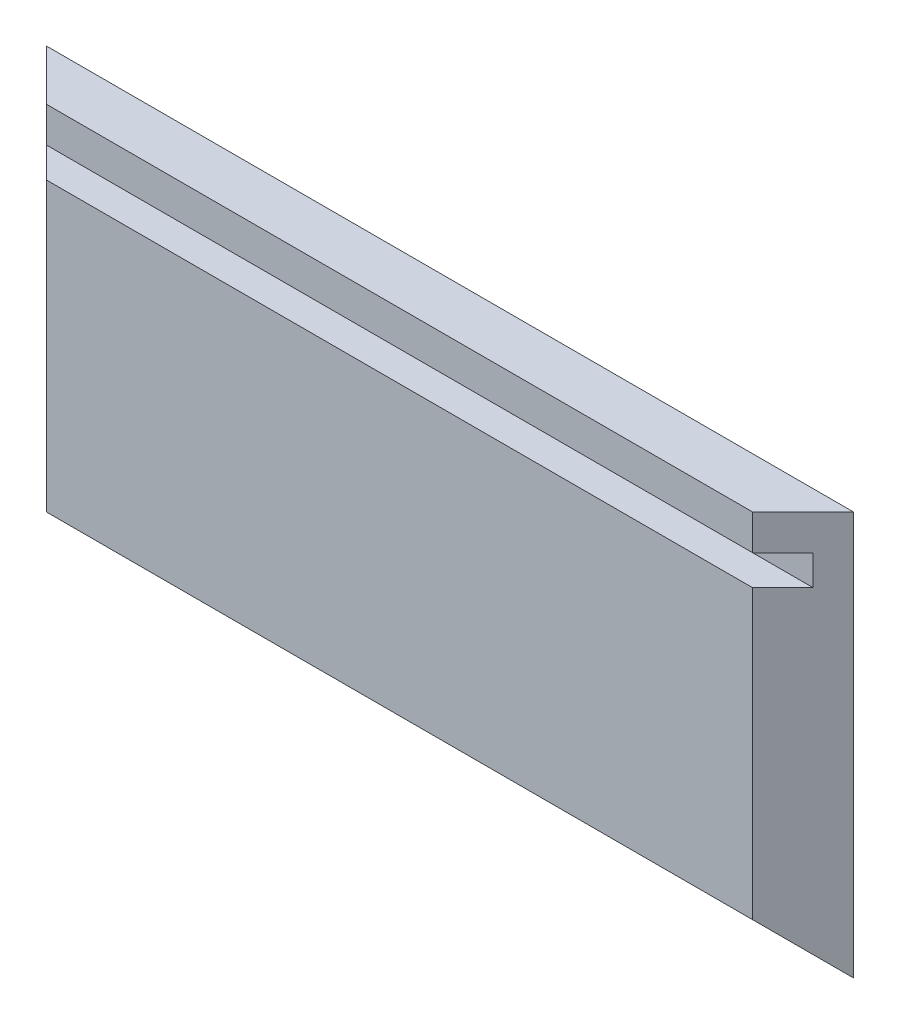
ISO-10303-21;
HEADER;
FILE_DESCRIPTION(('STEP AP214'),'2;1');
FILE_NAME('part.step','',(''),(''),'','','');
FILE_SCHEMA(('AUTOMOTIVE_DESIGN { 1 0 10303 214 1 1 1 1 }'));
ENDSEC;
DATA;
#1=APPLICATION_CONTEXT('core data for automotive mechanical design processes');
#2=APPLICATION_PROTOCOL_DEFINITION('international standard','automotive_design',2000,#1);
#3=PRODUCT_CONTEXT('',#1,'mechanical');
#4=PRODUCT('Part','Part','',(#3));
#5=PRODUCT_RELATED_PRODUCT_CATEGORY('part','',(#4));
#6=PRODUCT_DEFINITION_FORMATION('','',#4);
#7=PRODUCT_DEFINITION_CONTEXT('part definition',#1,'design');
#8=PRODUCT_DEFINITION('design','',#6,#7);
#9=PRODUCT_DEFINITION_SHAPE('','',#8);
#10=(LENGTH_UNIT() NAMED_UNIT(*) SI_UNIT(.MILLI.,.METRE.));
#11=(NAMED_UNIT(*) PLANE_ANGLE_UNIT() SI_UNIT($,.RADIAN.));
#12=(NAMED_UNIT(*) SI_UNIT($,.STERADIAN.) SOLID_ANGLE_UNIT());
#13=UNCERTAINTY_MEASURE_WITH_UNIT(LENGTH_MEASURE(1.E-05),#10,'distance_accuracy_value','');
#14=(GEOMETRIC_REPRESENTATION_CONTEXT(3) GLOBAL_UNCERTAINTY_ASSIGNED_CONTEXT((#13)) GLOBAL_UNIT_ASSIGNED_CONTEXT((#10,
#11,#12)) REPRESENTATION_CONTEXT('',''));
#15=CARTESIAN_POINT('',(0.,0.,0.));
#16=DIRECTION('',(0.,0.,1.));
#17=DIRECTION('',(1.,0.,0.));
#18=AXIS2_PLACEMENT_3D('',#15,#16,#17);
#19=CARTESIAN_POINT('',(-34.9999999999999,40.,2.5));
#20=DIRECTION('',(0.,0.,-1.));
#21=DIRECTION('',(-1.,0.,0.));
#22=AXIS2_PLACEMENT_3D('',#19,#20,#21);
#23=PLANE('',#22);
#24=DIRECTION('',(0.,-1.,0.));
#25=VECTOR('',#24,1.);
#26=CARTESIAN_POINT('',(-34.9999999999999,40.,2.5));
#27=LINE('',#26,#25);
#28=CARTESIAN_POINT('',(-34.9999999999999,40.,2.5));
#29=VERTEX_POINT('',#28);
#30=CARTESIAN_POINT('',(-34.9999999999999,36.5,2.5));
#31=VERTEX_POINT('',#30);
#32=EDGE_CURVE('E100',#29,#31,#27,.T.);
#33=ORIENTED_EDGE('',*,*,#32,.T.);
#34=DIRECTION('',(1.,0.,0.));
#35=VECTOR('',#34,1.);
#36=CARTESIAN_POINT('',(-40.,36.5,2.5));
#37=LINE('',#36,#35);
#38=CARTESIAN_POINT('',(34.9999999999999,36.5,2.5));
#39=VERTEX_POINT('',#38);
#40=EDGE_CURVE('E150',#31,#39,#37,.T.);
#41=ORIENTED_EDGE('',*,*,#40,.T.);
#42=DIRECTION('',(0.,-1.,0.));
#43=VECTOR('',#42,1.);
#44=CARTESIAN_POINT('',(34.9999999999999,40.,2.5));
#45=LINE('',#44,#43);
#46=CARTESIAN_POINT('',(34.9999999999999,40.,2.5));
#47=VERTEX_POINT('',#46);
#48=EDGE_CURVE('E112',#47,#39,#45,.T.);
#49=ORIENTED_EDGE('',*,*,#48,.F.);
#50=DIRECTION('',(1.,0.,0.));
#51=VECTOR('',#50,1.);
#52=CARTESIAN_POINT('',(-34.9999999999999,40.,2.5));
#53=LINE('',#52,#51);
#54=EDGE_CURVE('E91',#29,#47,#53,.T.);
#55=ORIENTED_EDGE('',*,*,#54,.F.);
#56=EDGE_LOOP('',(#33,#41,#49,#55));
#57=FACE_BOUND('',#56,.T.);
#58=ADVANCED_FACE('F33',(#57),#23,.F.);
#59=CARTESIAN_POINT('',(-40.,40.,-2.5));
#60=DIRECTION('',(0.,0.,1.));
#61=DIRECTION('',(1.,0.,0.));
#62=AXIS2_PLACEMENT_3D('',#59,#60,#61);
#63=PLANE('',#62);
#64=DIRECTION('',(-1.,0.,0.));
#65=VECTOR('',#64,1.);
#66=CARTESIAN_POINT('',(-40.,0.,-2.5));
#67=LINE('',#66,#65);
#68=CARTESIAN_POINT('',(40.,0.,-2.5));
#69=VERTEX_POINT('',#68);
#70=CARTESIAN_POINT('',(-40.,0.,-2.5));
#71=VERTEX_POINT('',#70);
#72=EDGE_CURVE('E118',#69,#71,#67,.T.);
#73=ORIENTED_EDGE('',*,*,#72,.T.);
#74=DIRECTION('',(0.,-1.,0.));
#75=VECTOR('',#74,1.);
#76=CARTESIAN_POINT('',(-40.,40.,-2.5));
#77=LINE('',#76,#75);
#78=CARTESIAN_POINT('',(-40.,40.,-2.5));
#79=VERTEX_POINT('',#78);
#80=EDGE_CURVE('E108',#79,#71,#77,.T.);
#81=ORIENTED_EDGE('',*,*,#80,.F.);
#82=DIRECTION('',(-1.,0.,0.));
#83=VECTOR('',#82,1.);
#84=CARTESIAN_POINT('',(-40.,40.,-2.5));
#85=LINE('',#84,#83);
#86=CARTESIAN_POINT('',(40.,40.,-2.5));
#87=VERTEX_POINT('',#86);
#88=EDGE_CURVE('E94',#87,#79,#85,.T.);
#89=ORIENTED_EDGE('',*,*,#88,.F.);
#90=DIRECTION('',(0.,-1.,0.));
#91=VECTOR('',#90,1.);
#92=CARTESIAN_POINT('',(40.,40.,-2.5));
#93=LINE('',#92,#91);
#94=EDGE_CURVE('E114',#87,#69,#93,.T.);
#95=ORIENTED_EDGE('',*,*,#94,.T.);
#96=EDGE_LOOP('',(#73,#81,#89,#95));
#97=FACE_BOUND('',#96,.T.);
#98=ADVANCED_FACE('F35',(#97),#63,.F.);
#99=CARTESIAN_POINT('',(-40.,40.,-2.5));
#100=DIRECTION('',(0.707106781186537,0.,-0.707106781186558));
#101=DIRECTION('',(-0.707106781186558,0.,-0.707106781186537));
#102=AXIS2_PLACEMENT_3D('',#99,#100,#101);
#103=PLANE('',#102);
#104=DIRECTION('',(0.,1.,0.));
#105=VECTOR('',#104,1.);
#106=CARTESIAN_POINT('',(-38.,40.,-0.499999999999998));
#107=LINE('',#106,#105);
#108=CARTESIAN_POINT('',(-38.,33.5,-0.499999999999997));
#109=VERTEX_POINT('',#108);
#110=CARTESIAN_POINT('',(-38.,36.5,-0.499999999999998));
#111=VERTEX_POINT('',#110);
#112=EDGE_CURVE('E159',#109,#111,#107,.T.);
#113=ORIENTED_EDGE('',*,*,#112,.T.);
#114=DIRECTION('',(0.707106781186558,0.,0.707106781186537));
#115=VECTOR('',#114,1.);
#116=CARTESIAN_POINT('',(-40.,36.5,-2.5));
#117=LINE('',#116,#115);
#118=EDGE_CURVE('E105',#111,#31,#117,.T.);
#119=ORIENTED_EDGE('',*,*,#118,.T.);
#120=ORIENTED_EDGE('',*,*,#32,.F.);
#121=DIRECTION('',(0.707106781186558,0.,0.707106781186537));
#122=VECTOR('',#121,1.);
#123=CARTESIAN_POINT('',(-40.,40.,-2.5));
#124=LINE('',#123,#122);
#125=EDGE_CURVE('E87',#79,#29,#124,.T.);
#126=ORIENTED_EDGE('',*,*,#125,.F.);
#127=ORIENTED_EDGE('',*,*,#80,.T.);
#128=DIRECTION('',(0.577350269189639,0.577350269189616,0.577350269189622));
#129=VECTOR('',#128,1.);
#130=CARTESIAN_POINT('',(-26.6666666666666,13.3333333333329,10.833333333333));
#131=LINE('',#130,#129);
#132=CARTESIAN_POINT('',(-34.9999999999999,4.99999999999995,2.5));
#133=VERTEX_POINT('',#132);
#134=EDGE_CURVE('E70',#71,#133,#131,.T.);
#135=ORIENTED_EDGE('',*,*,#134,.T.);
#136=CARTESIAN_POINT('',(-34.9999999999999,33.5,2.5));
#137=VERTEX_POINT('',#136);
#138=EDGE_CURVE('E109',#137,#133,#27,.T.);
#139=ORIENTED_EDGE('',*,*,#138,.F.);
#140=DIRECTION('',(-0.707106781186558,0.,-0.707106781186537));
#141=VECTOR('',#140,1.);
#142=CARTESIAN_POINT('',(-40.,33.5,-2.5));
#143=LINE('',#142,#141);
#144=EDGE_CURVE('E152',#137,#109,#143,.T.);
#145=ORIENTED_EDGE('',*,*,#144,.T.);
#146=EDGE_LOOP('',(#113,#119,#120,#126,#127,#135,#139,#145));
#147=FACE_BOUND('',#146,.T.);
#148=ADVANCED_FACE('F102',(#147),#103,.F.);
#149=CARTESIAN_POINT('',(34.9999999999999,33.5,2.5));
#150=VERTEX_POINT('',#149);
#151=CARTESIAN_POINT('',(34.9999999999999,4.99999999999995,2.50000000000001));
#152=VERTEX_POINT('',#151);
#153=EDGE_CURVE('E80',#150,#152,#45,.T.);
#154=ORIENTED_EDGE('',*,*,#153,.F.);
#155=DIRECTION('',(1.,0.,0.));
#156=VECTOR('',#155,1.);
#157=CARTESIAN_POINT('',(-40.,33.5,2.5));
#158=LINE('',#157,#156);
#159=EDGE_CURVE('E48',#137,#150,#158,.T.);
#160=ORIENTED_EDGE('',*,*,#159,.F.);
#161=ORIENTED_EDGE('',*,*,#138,.T.);
#162=DIRECTION('',(1.,0.,0.));
#163=VECTOR('',#162,1.);
#164=CARTESIAN_POINT('',(-40.,4.99999999999995,2.5));
#165=LINE('',#164,#163);
#166=EDGE_CURVE('E162',#133,#152,#165,.T.);
#167=ORIENTED_EDGE('',*,*,#166,.T.);
#168=EDGE_LOOP('',(#154,#160,#161,#167));
#169=FACE_BOUND('',#168,.T.);
#170=ADVANCED_FACE('F177',(#169),#23,.F.);
#171=CARTESIAN_POINT('',(40.,40.,-2.5));
#172=DIRECTION('',(-0.707106781186544,0.,-0.707106781186552));
#173=DIRECTION('',(-0.707106781186551,0.,0.707106781186544));
#174=AXIS2_PLACEMENT_3D('',#171,#172,#173);
#175=PLANE('',#174);
#176=ORIENTED_EDGE('',*,*,#48,.T.);
#177=DIRECTION('',(0.707106781186551,0.,-0.707106781186544));
#178=VECTOR('',#177,1.);
#179=CARTESIAN_POINT('',(40.,36.5,-2.5));
#180=LINE('',#179,#178);
#181=CARTESIAN_POINT('',(37.9999999999999,36.5,-0.499999999999998));
#182=VERTEX_POINT('',#181);
#183=EDGE_CURVE('E11',#39,#182,#180,.T.);
#184=ORIENTED_EDGE('',*,*,#183,.T.);
#185=DIRECTION('',(0.,-1.,0.));
#186=VECTOR('',#185,1.);
#187=CARTESIAN_POINT('',(38.,40.,-0.499999999999998));
#188=LINE('',#187,#186);
#189=CARTESIAN_POINT('',(38.,33.5,-0.499999999999995));
#190=VERTEX_POINT('',#189);
#191=EDGE_CURVE('E41',#182,#190,#188,.T.);
#192=ORIENTED_EDGE('',*,*,#191,.T.);
#193=DIRECTION('',(-0.707106781186551,0.,0.707106781186544));
#194=VECTOR('',#193,1.);
#195=CARTESIAN_POINT('',(40.,33.5,-2.5));
#196=LINE('',#195,#194);
#197=EDGE_CURVE('E125',#190,#150,#196,.T.);
#198=ORIENTED_EDGE('',*,*,#197,.T.);
#199=ORIENTED_EDGE('',*,*,#153,.T.);
#200=DIRECTION('',(0.577350269189632,-0.57735026918962,-0.577350269189626));
#201=VECTOR('',#200,1.);
#202=CARTESIAN_POINT('',(26.6666666666666,13.333333333333,10.8333333333332));
#203=LINE('',#202,#201);
#204=EDGE_CURVE('E165',#152,#69,#203,.T.);
#205=ORIENTED_EDGE('',*,*,#204,.T.);
#206=ORIENTED_EDGE('',*,*,#94,.F.);
#207=DIRECTION('',(0.707106781186552,0.,-0.707106781186544));
#208=VECTOR('',#207,1.);
#209=CARTESIAN_POINT('',(40.,40.,-2.5));
#210=LINE('',#209,#208);
#211=EDGE_CURVE('E57',#47,#87,#210,.T.);
#212=ORIENTED_EDGE('',*,*,#211,.F.);
#213=EDGE_LOOP('',(#176,#184,#192,#198,#199,#205,#206,#212));
#214=FACE_BOUND('',#213,.T.);
#215=ADVANCED_FACE('F129',(#214),#175,.F.);
#216=CARTESIAN_POINT('',(0.,40.,0.));
#217=DIRECTION('',(0.,-1.,0.));
#218=DIRECTION('',(0.,0.,-1.));
#219=AXIS2_PLACEMENT_3D('',#216,#217,#218);
#220=PLANE('',#219);
#221=ORIENTED_EDGE('',*,*,#88,.T.);
#222=ORIENTED_EDGE('',*,*,#125,.T.);
#223=ORIENTED_EDGE('',*,*,#54,.T.);
#224=ORIENTED_EDGE('',*,*,#211,.T.);
#225=EDGE_LOOP('',(#221,#222,#223,#224));
#226=FACE_BOUND('',#225,.T.);
#227=ADVANCED_FACE('F89',(#226),#220,.F.);
#228=CARTESIAN_POINT('',(-40.,0.,-2.5));
#229=DIRECTION('',(0.,0.707106781186551,-0.707106781186544));
#230=DIRECTION('',(0.,0.707106781186544,0.707106781186551));
#231=AXIS2_PLACEMENT_3D('',#228,#229,#230);
#232=PLANE('',#231);
#233=ORIENTED_EDGE('',*,*,#72,.F.);
#234=ORIENTED_EDGE('',*,*,#204,.F.);
#235=ORIENTED_EDGE('',*,*,#166,.F.);
#236=ORIENTED_EDGE('',*,*,#134,.F.);
#237=EDGE_LOOP('',(#233,#234,#235,#236));
#238=FACE_BOUND('',#237,.T.);
#239=ADVANCED_FACE('F169',(#238),#232,.F.);
#240=CARTESIAN_POINT('',(-40.,36.5,2.5));
#241=DIRECTION('',(0.,1.,0.));
#242=DIRECTION('',(0.,0.,1.));
#243=AXIS2_PLACEMENT_3D('',#240,#241,#242);
#244=PLANE('',#243);
#245=DIRECTION('',(1.,0.,0.));
#246=VECTOR('',#245,1.);
#247=CARTESIAN_POINT('',(-40.,36.5,-0.499999999999998));
#248=LINE('',#247,#246);
#249=EDGE_CURVE('E142',#111,#182,#248,.T.);
#250=ORIENTED_EDGE('',*,*,#249,.T.);
#251=ORIENTED_EDGE('',*,*,#183,.F.);
#252=ORIENTED_EDGE('',*,*,#40,.F.);
#253=ORIENTED_EDGE('',*,*,#118,.F.);
#254=EDGE_LOOP('',(#250,#251,#252,#253));
#255=FACE_BOUND('',#254,.T.);
#256=ADVANCED_FACE('F147',(#255),#244,.F.);
#257=CARTESIAN_POINT('',(-40.,36.5,-0.499999999999998));
#258=DIRECTION('',(0.,0.,-1.));
#259=DIRECTION('',(-1.,0.,0.));
#260=AXIS2_PLACEMENT_3D('',#257,#258,#259);
#261=PLANE('',#260);
#262=DIRECTION('',(1.,0.,0.));
#263=VECTOR('',#262,1.);
#264=CARTESIAN_POINT('',(-40.,33.5,-0.499999999999998));
#265=LINE('',#264,#263);
#266=EDGE_CURVE('E144',#109,#190,#265,.T.);
#267=ORIENTED_EDGE('',*,*,#266,.T.);
#268=ORIENTED_EDGE('',*,*,#191,.F.);
#269=ORIENTED_EDGE('',*,*,#249,.F.);
#270=ORIENTED_EDGE('',*,*,#112,.F.);
#271=EDGE_LOOP('',(#267,#268,#269,#270));
#272=FACE_BOUND('',#271,.T.);
#273=ADVANCED_FACE('F139',(#272),#261,.F.);
#274=CARTESIAN_POINT('',(-40.,33.5,2.5));
#275=DIRECTION('',(0.,-1.,0.));
#276=DIRECTION('',(0.,0.,-1.));
#277=AXIS2_PLACEMENT_3D('',#274,#275,#276);
#278=PLANE('',#277);
#279=ORIENTED_EDGE('',*,*,#159,.T.);
#280=ORIENTED_EDGE('',*,*,#197,.F.);
#281=ORIENTED_EDGE('',*,*,#266,.F.);
#282=ORIENTED_EDGE('',*,*,#144,.F.);
#283=EDGE_LOOP('',(#279,#280,#281,#282));
#284=FACE_BOUND('',#283,.T.);
#285=ADVANCED_FACE('F175',(#284),#278,.F.);
#286=CLOSED_SHELL('',(#58,#98,#148,#170,#215,#227,#239,#256,#273,#285));
#287=MANIFOLD_SOLID_BREP('B2',#286);
#288=ADVANCED_BREP_SHAPE_REPRESENTATION('',(#18,#287),#14);
#289=SHAPE_DEFINITION_REPRESENTATION(#9,#288);
ENDSEC;
END-ISO-10303-21;
